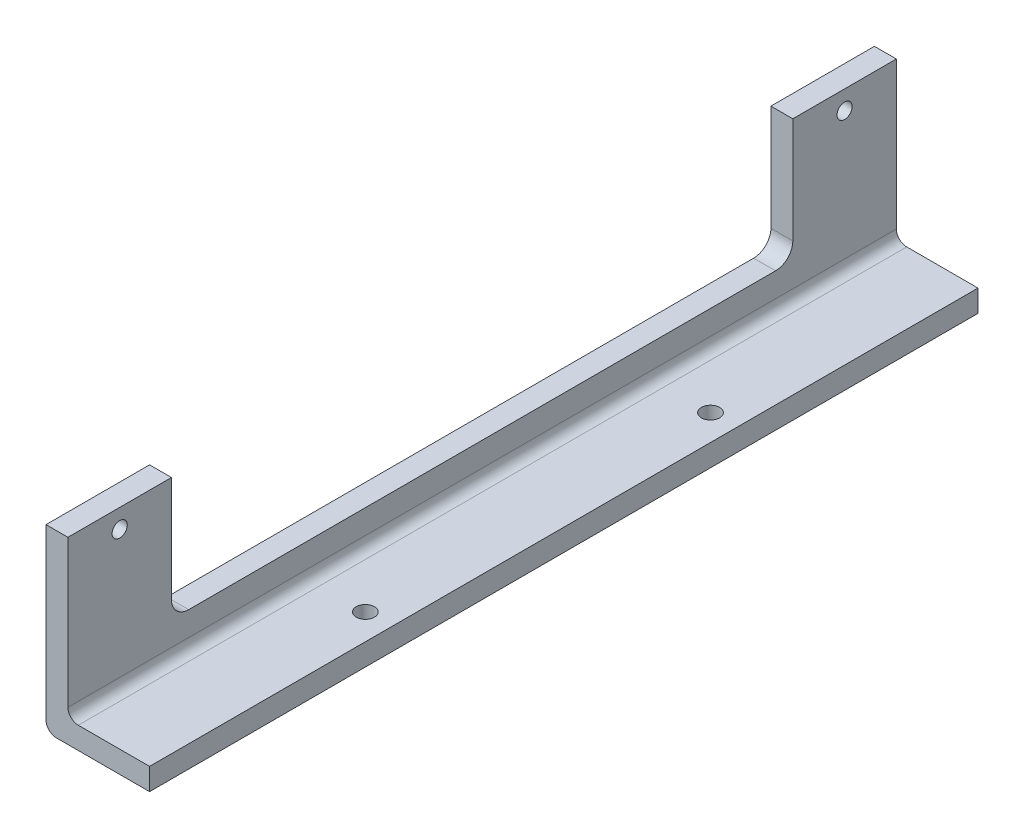
ISO-10303-21;
HEADER;
FILE_DESCRIPTION(('STEP AP214'),'2;1');
FILE_NAME('part.step','',(''),(''),'','','');
FILE_SCHEMA(('AUTOMOTIVE_DESIGN { 1 0 10303 214 1 1 1 1 }'));
ENDSEC;
DATA;
#1=APPLICATION_CONTEXT('core data for automotive mechanical design processes');
#2=APPLICATION_PROTOCOL_DEFINITION('international standard','automotive_design',2000,#1);
#3=PRODUCT_CONTEXT('',#1,'mechanical');
#4=PRODUCT('Part','Part','',(#3));
#5=PRODUCT_RELATED_PRODUCT_CATEGORY('part','',(#4));
#6=PRODUCT_DEFINITION_FORMATION('','',#4);
#7=PRODUCT_DEFINITION_CONTEXT('part definition',#1,'design');
#8=PRODUCT_DEFINITION('design','',#6,#7);
#9=PRODUCT_DEFINITION_SHAPE('','',#8);
#10=(LENGTH_UNIT() NAMED_UNIT(*) SI_UNIT(.MILLI.,.METRE.));
#11=(NAMED_UNIT(*) PLANE_ANGLE_UNIT() SI_UNIT($,.RADIAN.));
#12=(NAMED_UNIT(*) SI_UNIT($,.STERADIAN.) SOLID_ANGLE_UNIT());
#13=UNCERTAINTY_MEASURE_WITH_UNIT(LENGTH_MEASURE(1.E-05),#10,'distance_accuracy_value','');
#14=(GEOMETRIC_REPRESENTATION_CONTEXT(3) GLOBAL_UNCERTAINTY_ASSIGNED_CONTEXT((#13)) GLOBAL_UNIT_ASSIGNED_CONTEXT((#10,
#11,#12)) REPRESENTATION_CONTEXT('',''));
#15=CARTESIAN_POINT('',(0.,0.,0.));
#16=DIRECTION('',(0.,0.,1.));
#17=DIRECTION('',(1.,0.,0.));
#18=AXIS2_PLACEMENT_3D('',#15,#16,#17);
#19=CARTESIAN_POINT('',(0.,52.,5.));
#20=DIRECTION('',(0.,-1.,0.));
#21=DIRECTION('',(0.,0.,-1.));
#22=AXIS2_PLACEMENT_3D('',#19,#20,#21);
#23=PLANE('',#22);
#24=DIRECTION('',(0.,0.,-1.));
#25=VECTOR('',#24,1.);
#26=CARTESIAN_POINT('',(6.34999999999999,52.,5.));
#27=LINE('',#26,#25);
#28=CARTESIAN_POINT('',(6.34999999999999,52.,0.));
#29=VERTEX_POINT('',#28);
#30=CARTESIAN_POINT('',(6.34999999999999,52.,-30.));
#31=VERTEX_POINT('',#30);
#32=EDGE_CURVE('E210',#29,#31,#27,.T.);
#33=ORIENTED_EDGE('',*,*,#32,.T.);
#34=DIRECTION('',(-1.,0.,0.));
#35=VECTOR('',#34,1.);
#36=CARTESIAN_POINT('',(0.,52.,-30.));
#37=LINE('',#36,#35);
#38=CARTESIAN_POINT('',(0.,52.,-30.));
#39=VERTEX_POINT('',#38);
#40=EDGE_CURVE('E250',#31,#39,#37,.T.);
#41=ORIENTED_EDGE('',*,*,#40,.T.);
#42=DIRECTION('',(0.,0.,-1.));
#43=VECTOR('',#42,1.);
#44=CARTESIAN_POINT('',(0.,52.,5.));
#45=LINE('',#44,#43);
#46=CARTESIAN_POINT('',(0.,52.,0.));
#47=VERTEX_POINT('',#46);
#48=EDGE_CURVE('E178',#47,#39,#45,.T.);
#49=ORIENTED_EDGE('',*,*,#48,.F.);
#50=DIRECTION('',(-1.,0.,0.));
#51=VECTOR('',#50,1.);
#52=CARTESIAN_POINT('',(6.34999999999999,52.,0.));
#53=LINE('',#52,#51);
#54=EDGE_CURVE('E244',#29,#47,#53,.T.);
#55=ORIENTED_EDGE('',*,*,#54,.F.);
#56=EDGE_LOOP('',(#33,#41,#49,#55));
#57=FACE_BOUND('',#56,.T.);
#58=ADVANCED_FACE('F52',(#57),#23,.F.);
#59=CARTESIAN_POINT('',(6.35000000000002,0.,-240.));
#60=DIRECTION('',(1.,0.,0.));
#61=DIRECTION('',(0.,0.,-1.));
#62=AXIS2_PLACEMENT_3D('',#59,#60,#61);
#63=PLANE('',#62);
#64=CARTESIAN_POINT('',(6.35000000000002,46.5,-15.));
#65=DIRECTION('',(1.,0.,0.));
#66=DIRECTION('',(0.,0.,-1.));
#67=AXIS2_PLACEMENT_3D('',#64,#65,#66);
#68=CIRCLE('',#67,2.1971);
#69=CARTESIAN_POINT('',(6.35000000000002,46.5,-17.1971));
#70=VERTEX_POINT('',#69);
#71=EDGE_CURVE('E256',#70,#70,#68,.T.);
#72=ORIENTED_EDGE('',*,*,#71,.F.);
#73=EDGE_LOOP('',(#72));
#74=FACE_BOUND('',#73,.T.);
#75=CARTESIAN_POINT('',(6.35000000000005,46.5,-225.));
#76=DIRECTION('',(1.,0.,0.));
#77=DIRECTION('',(0.,0.,-1.));
#78=AXIS2_PLACEMENT_3D('',#75,#76,#77);
#79=CIRCLE('',#78,2.1971);
#80=CARTESIAN_POINT('',(6.35000000000005,46.5,-227.1971));
#81=VERTEX_POINT('',#80);
#82=EDGE_CURVE('E402',#81,#81,#79,.T.);
#83=ORIENTED_EDGE('',*,*,#82,.F.);
#84=EDGE_LOOP('',(#83));
#85=FACE_BOUND('',#84,.T.);
#86=DIRECTION('',(0.,1.,0.));
#87=VECTOR('',#86,1.);
#88=CARTESIAN_POINT('',(6.34999999999999,0.,0.));
#89=LINE('',#88,#87);
#90=CARTESIAN_POINT('',(6.35000000000002,9.35000000000001,0.));
#91=VERTEX_POINT('',#90);
#92=EDGE_CURVE('E222',#91,#29,#89,.T.);
#93=ORIENTED_EDGE('',*,*,#92,.F.);
#94=DIRECTION('',(0.,0.,1.));
#95=VECTOR('',#94,1.);
#96=CARTESIAN_POINT('',(6.35000000000005,9.35000000000001,-240.));
#97=LINE('',#96,#95);
#98=CARTESIAN_POINT('',(6.35000000000005,9.35000000000001,-240.));
#99=VERTEX_POINT('',#98);
#100=EDGE_CURVE('E73',#91,#99,#97,.F.);
#101=ORIENTED_EDGE('',*,*,#100,.T.);
#102=DIRECTION('',(0.,1.,0.));
#103=VECTOR('',#102,1.);
#104=CARTESIAN_POINT('',(6.35000000000002,0.,-240.));
#105=LINE('',#104,#103);
#106=CARTESIAN_POINT('',(6.35000000000002,52.,-240.));
#107=VERTEX_POINT('',#106);
#108=EDGE_CURVE('E223',#99,#107,#105,.T.);
#109=ORIENTED_EDGE('',*,*,#108,.T.);
#110=CARTESIAN_POINT('',(6.35000000000002,52.,-210.));
#111=VERTEX_POINT('',#110);
#112=EDGE_CURVE('E203',#111,#107,#27,.T.);
#113=ORIENTED_EDGE('',*,*,#112,.F.);
#114=DIRECTION('',(0.,1.,0.));
#115=VECTOR('',#114,1.);
#116=CARTESIAN_POINT('',(6.35000000000004,66.35,-210.));
#117=LINE('',#116,#115);
#118=CARTESIAN_POINT('',(6.35000000000002,21.35,-210.));
#119=VERTEX_POINT('',#118);
#120=EDGE_CURVE('E179',#119,#111,#117,.T.);
#121=ORIENTED_EDGE('',*,*,#120,.F.);
#122=CARTESIAN_POINT('',(6.35000000000002,21.35,-205.));
#123=DIRECTION('',(1.,0.,0.));
#124=DIRECTION('',(0.,0.,1.));
#125=AXIS2_PLACEMENT_3D('',#122,#123,#124);
#126=CIRCLE('',#125,5.);
#127=CARTESIAN_POINT('',(6.35000000000004,16.35,-205.));
#128=VERTEX_POINT('',#127);
#129=EDGE_CURVE('E181',#128,#119,#126,.T.);
#130=ORIENTED_EDGE('',*,*,#129,.F.);
#131=DIRECTION('',(0.,0.,-1.));
#132=VECTOR('',#131,1.);
#133=CARTESIAN_POINT('',(6.35000000000002,16.35,-35.));
#134=LINE('',#133,#132);
#135=CARTESIAN_POINT('',(6.35000000000002,16.35,-35.));
#136=VERTEX_POINT('',#135);
#137=EDGE_CURVE('E196',#136,#128,#134,.T.);
#138=ORIENTED_EDGE('',*,*,#137,.F.);
#139=CARTESIAN_POINT('',(6.35000000000001,21.35,-35.));
#140=DIRECTION('',(1.,0.,0.));
#141=DIRECTION('',(0.,0.,1.));
#142=AXIS2_PLACEMENT_3D('',#139,#140,#141);
#143=CIRCLE('',#142,5.);
#144=CARTESIAN_POINT('',(6.35000000000001,21.35,-30.));
#145=VERTEX_POINT('',#144);
#146=EDGE_CURVE('E194',#145,#136,#143,.T.);
#147=ORIENTED_EDGE('',*,*,#146,.F.);
#148=DIRECTION('',(0.,-1.,0.));
#149=VECTOR('',#148,1.);
#150=CARTESIAN_POINT('',(6.35000000000002,66.35,-30.));
#151=LINE('',#150,#149);
#152=EDGE_CURVE('E159',#31,#145,#151,.T.);
#153=ORIENTED_EDGE('',*,*,#152,.F.);
#154=ORIENTED_EDGE('',*,*,#32,.F.);
#155=EDGE_LOOP('',(#93,#101,#109,#113,#121,#130,#138,#147,#153,#154));
#156=FACE_BOUND('',#155,.T.);
#157=ADVANCED_FACE('F282',(#74,#85,#156),#63,.T.);
#158=CARTESIAN_POINT('',(0.,6.35000000000002,-240.));
#159=DIRECTION('',(0.,1.,0.));
#160=DIRECTION('',(0.,0.,1.));
#161=AXIS2_PLACEMENT_3D('',#158,#159,#160);
#162=PLANE('',#161);
#163=CARTESIAN_POINT('',(22.5,6.35000000000001,-69.9999999999999));
#164=DIRECTION('',(0.,1.,0.));
#165=DIRECTION('',(0.,0.,1.));
#166=AXIS2_PLACEMENT_3D('',#163,#164,#165);
#167=CIRCLE('',#166,2.63778999999999);
#168=CARTESIAN_POINT('',(22.5,6.35000000000001,-67.3622099999999));
#169=VERTEX_POINT('',#168);
#170=EDGE_CURVE('E384',#169,#169,#167,.T.);
#171=ORIENTED_EDGE('',*,*,#170,.F.);
#172=EDGE_LOOP('',(#171));
#173=FACE_BOUND('',#172,.T.);
#174=CARTESIAN_POINT('',(22.5,6.35000000000002,-170.));
#175=DIRECTION('',(0.,1.,0.));
#176=DIRECTION('',(0.,0.,1.));
#177=AXIS2_PLACEMENT_3D('',#174,#175,#176);
#178=CIRCLE('',#177,2.63778999999999);
#179=CARTESIAN_POINT('',(22.5,6.35000000000002,-167.36221));
#180=VERTEX_POINT('',#179);
#181=EDGE_CURVE('E261',#180,#180,#178,.T.);
#182=ORIENTED_EDGE('',*,*,#181,.F.);
#183=EDGE_LOOP('',(#182));
#184=FACE_BOUND('',#183,.T.);
#185=DIRECTION('',(1.,0.,0.));
#186=VECTOR('',#185,1.);
#187=CARTESIAN_POINT('',(0.,6.35000000000002,-240.));
#188=LINE('',#187,#186);
#189=CARTESIAN_POINT('',(30.0000000000001,6.35000000000001,-240.));
#190=VERTEX_POINT('',#189);
#191=CARTESIAN_POINT('',(9.35000000000002,6.35000000000002,-240.));
#192=VERTEX_POINT('',#191);
#193=EDGE_CURVE('E231',#190,#192,#188,.F.);
#194=ORIENTED_EDGE('',*,*,#193,.T.);
#195=DIRECTION('',(0.,0.,1.));
#196=VECTOR('',#195,1.);
#197=CARTESIAN_POINT('',(9.35,6.35,1.11022302462516E-13));
#198=LINE('',#197,#196);
#199=CARTESIAN_POINT('',(9.35,6.35,1.11022302462516E-13));
#200=VERTEX_POINT('',#199);
#201=EDGE_CURVE('E271',#192,#200,#198,.T.);
#202=ORIENTED_EDGE('',*,*,#201,.T.);
#203=DIRECTION('',(1.,0.,0.));
#204=VECTOR('',#203,1.);
#205=CARTESIAN_POINT('',(0.,6.35,0.));
#206=LINE('',#205,#204);
#207=CARTESIAN_POINT('',(30.,6.35,1.11022302462516E-13));
#208=VERTEX_POINT('',#207);
#209=EDGE_CURVE('E226',#208,#200,#206,.F.);
#210=ORIENTED_EDGE('',*,*,#209,.F.);
#211=DIRECTION('',(0.,0.,1.));
#212=VECTOR('',#211,1.);
#213=CARTESIAN_POINT('',(30.0000000000001,6.35000000000001,-245.));
#214=LINE('',#213,#212);
#215=EDGE_CURVE('E215',#190,#208,#214,.T.);
#216=ORIENTED_EDGE('',*,*,#215,.F.);
#217=EDGE_LOOP('',(#194,#202,#210,#216));
#218=FACE_BOUND('',#217,.T.);
#219=ADVANCED_FACE('F284',(#173,#184,#218),#162,.T.);
#220=CARTESIAN_POINT('',(0.,0.,-240.));
#221=DIRECTION('',(0.,1.,0.));
#222=DIRECTION('',(0.,0.,1.));
#223=AXIS2_PLACEMENT_3D('',#220,#221,#222);
#224=PLANE('',#223);
#225=CARTESIAN_POINT('',(22.5,0.,-69.9999999999999));
#226=DIRECTION('',(0.,1.,0.));
#227=DIRECTION('',(0.,0.,1.));
#228=AXIS2_PLACEMENT_3D('',#225,#226,#227);
#229=CIRCLE('',#228,2.1971);
#230=CARTESIAN_POINT('',(22.5,0.,-67.8028999999999));
#231=VERTEX_POINT('',#230);
#232=EDGE_CURVE('E258',#231,#231,#229,.T.);
#233=ORIENTED_EDGE('',*,*,#232,.T.);
#234=EDGE_LOOP('',(#233));
#235=FACE_BOUND('',#234,.T.);
#236=CARTESIAN_POINT('',(22.5,0.,-170.));
#237=DIRECTION('',(0.,1.,0.));
#238=DIRECTION('',(0.,0.,1.));
#239=AXIS2_PLACEMENT_3D('',#236,#237,#238);
#240=CIRCLE('',#239,2.1971);
#241=CARTESIAN_POINT('',(22.5,0.,-167.8029));
#242=VERTEX_POINT('',#241);
#243=EDGE_CURVE('E253',#242,#242,#240,.T.);
#244=ORIENTED_EDGE('',*,*,#243,.T.);
#245=EDGE_LOOP('',(#244));
#246=FACE_BOUND('',#245,.T.);
#247=DIRECTION('',(-1.,0.,0.));
#248=VECTOR('',#247,1.);
#249=CARTESIAN_POINT('',(0.,0.,0.));
#250=LINE('',#249,#248);
#251=CARTESIAN_POINT('',(30.0000000000001,0.,1.11022302462516E-13));
#252=VERTEX_POINT('',#251);
#253=CARTESIAN_POINT('',(3.,0.,1.11022302462516E-13));
#254=VERTEX_POINT('',#253);
#255=EDGE_CURVE('E237',#252,#254,#250,.T.);
#256=ORIENTED_EDGE('',*,*,#255,.T.);
#257=DIRECTION('',(0.,0.,1.));
#258=VECTOR('',#257,1.);
#259=CARTESIAN_POINT('',(3.00000000000003,0.,-240.));
#260=LINE('',#259,#258);
#261=CARTESIAN_POINT('',(3.00000000000003,0.,-240.));
#262=VERTEX_POINT('',#261);
#263=EDGE_CURVE('E267',#254,#262,#260,.F.);
#264=ORIENTED_EDGE('',*,*,#263,.T.);
#265=DIRECTION('',(-1.,0.,0.));
#266=VECTOR('',#265,1.);
#267=CARTESIAN_POINT('',(0.,0.,-240.));
#268=LINE('',#267,#266);
#269=CARTESIAN_POINT('',(30.0000000000001,0.,-240.));
#270=VERTEX_POINT('',#269);
#271=EDGE_CURVE('E228',#270,#262,#268,.T.);
#272=ORIENTED_EDGE('',*,*,#271,.F.);
#273=DIRECTION('',(0.,0.,1.));
#274=VECTOR('',#273,1.);
#275=CARTESIAN_POINT('',(30.0000000000001,0.,-245.));
#276=LINE('',#275,#274);
#277=EDGE_CURVE('E216',#270,#252,#276,.T.);
#278=ORIENTED_EDGE('',*,*,#277,.T.);
#279=EDGE_LOOP('',(#256,#264,#272,#278));
#280=FACE_BOUND('',#279,.T.);
#281=ADVANCED_FACE('F292',(#235,#246,#280),#224,.F.);
#282=CARTESIAN_POINT('',(0.,0.,-240.));
#283=DIRECTION('',(1.,0.,0.));
#284=DIRECTION('',(0.,0.,-1.));
#285=AXIS2_PLACEMENT_3D('',#282,#283,#284);
#286=PLANE('',#285);
#287=CARTESIAN_POINT('',(0.,46.5,-15.));
#288=DIRECTION('',(1.,0.,0.));
#289=DIRECTION('',(0.,0.,-1.));
#290=AXIS2_PLACEMENT_3D('',#287,#288,#289);
#291=CIRCLE('',#290,2.1971);
#292=CARTESIAN_POINT('',(0.,46.5,-17.1971));
#293=VERTEX_POINT('',#292);
#294=EDGE_CURVE('E400',#293,#293,#291,.T.);
#295=ORIENTED_EDGE('',*,*,#294,.T.);
#296=EDGE_LOOP('',(#295));
#297=FACE_BOUND('',#296,.T.);
#298=CARTESIAN_POINT('',(0.,46.5,-225.));
#299=DIRECTION('',(1.,0.,0.));
#300=DIRECTION('',(0.,0.,-1.));
#301=AXIS2_PLACEMENT_3D('',#298,#299,#300);
#302=CIRCLE('',#301,2.1971);
#303=CARTESIAN_POINT('',(0.,46.5,-227.1971));
#304=VERTEX_POINT('',#303);
#305=EDGE_CURVE('E184',#304,#304,#302,.T.);
#306=ORIENTED_EDGE('',*,*,#305,.T.);
#307=EDGE_LOOP('',(#306));
#308=FACE_BOUND('',#307,.T.);
#309=DIRECTION('',(0.,1.,0.));
#310=VECTOR('',#309,1.);
#311=CARTESIAN_POINT('',(0.,0.,-240.));
#312=LINE('',#311,#310);
#313=CARTESIAN_POINT('',(0.,3.00000000000002,-240.));
#314=VERTEX_POINT('',#313);
#315=CARTESIAN_POINT('',(0.,52.,-240.));
#316=VERTEX_POINT('',#315);
#317=EDGE_CURVE('E225',#314,#316,#312,.T.);
#318=ORIENTED_EDGE('',*,*,#317,.F.);
#319=DIRECTION('',(0.,0.,1.));
#320=VECTOR('',#319,1.);
#321=CARTESIAN_POINT('',(0.,3.00000000000002,-240.));
#322=LINE('',#321,#320);
#323=CARTESIAN_POINT('',(0.,3.,0.));
#324=VERTEX_POINT('',#323);
#325=EDGE_CURVE('E252',#314,#324,#322,.T.);
#326=ORIENTED_EDGE('',*,*,#325,.T.);
#327=DIRECTION('',(0.,1.,0.));
#328=VECTOR('',#327,1.);
#329=CARTESIAN_POINT('',(0.,0.,0.));
#330=LINE('',#329,#328);
#331=EDGE_CURVE('E235',#324,#47,#330,.T.);
#332=ORIENTED_EDGE('',*,*,#331,.T.);
#333=ORIENTED_EDGE('',*,*,#48,.T.);
#334=DIRECTION('',(0.,-1.,0.));
#335=VECTOR('',#334,1.);
#336=CARTESIAN_POINT('',(0.,66.35,-30.));
#337=LINE('',#336,#335);
#338=CARTESIAN_POINT('',(0.,21.35,-30.));
#339=VERTEX_POINT('',#338);
#340=EDGE_CURVE('E156',#39,#339,#337,.T.);
#341=ORIENTED_EDGE('',*,*,#340,.T.);
#342=CARTESIAN_POINT('',(0.,21.35,-35.));
#343=DIRECTION('',(1.,0.,0.));
#344=DIRECTION('',(0.,0.,1.));
#345=AXIS2_PLACEMENT_3D('',#342,#343,#344);
#346=CIRCLE('',#345,5.);
#347=CARTESIAN_POINT('',(0.,16.35,-35.));
#348=VERTEX_POINT('',#347);
#349=EDGE_CURVE('E167',#339,#348,#346,.T.);
#350=ORIENTED_EDGE('',*,*,#349,.T.);
#351=DIRECTION('',(0.,0.,-1.));
#352=VECTOR('',#351,1.);
#353=CARTESIAN_POINT('',(0.,16.35,-35.));
#354=LINE('',#353,#352);
#355=CARTESIAN_POINT('',(0.,16.35,-205.));
#356=VERTEX_POINT('',#355);
#357=EDGE_CURVE('E172',#348,#356,#354,.T.);
#358=ORIENTED_EDGE('',*,*,#357,.T.);
#359=CARTESIAN_POINT('',(0.,21.35,-205.));
#360=DIRECTION('',(1.,0.,0.));
#361=DIRECTION('',(0.,0.,1.));
#362=AXIS2_PLACEMENT_3D('',#359,#360,#361);
#363=CIRCLE('',#362,5.);
#364=CARTESIAN_POINT('',(0.,21.35,-210.));
#365=VERTEX_POINT('',#364);
#366=EDGE_CURVE('E188',#356,#365,#363,.T.);
#367=ORIENTED_EDGE('',*,*,#366,.T.);
#368=DIRECTION('',(0.,1.,0.));
#369=VECTOR('',#368,1.);
#370=CARTESIAN_POINT('',(0.,66.35,-210.));
#371=LINE('',#370,#369);
#372=CARTESIAN_POINT('',(0.,52.,-210.));
#373=VERTEX_POINT('',#372);
#374=EDGE_CURVE('E164',#365,#373,#371,.T.);
#375=ORIENTED_EDGE('',*,*,#374,.T.);
#376=EDGE_CURVE('E209',#373,#316,#45,.T.);
#377=ORIENTED_EDGE('',*,*,#376,.T.);
#378=EDGE_LOOP('',(#318,#326,#332,#333,#341,#350,#358,#367,#375,#377));
#379=FACE_BOUND('',#378,.T.);
#380=ADVANCED_FACE('F176',(#297,#308,#379),#286,.F.);
#381=CARTESIAN_POINT('',(6.35000000000002,55.,-240.));
#382=DIRECTION('',(0.,0.,-1.));
#383=DIRECTION('',(-1.,0.,0.));
#384=AXIS2_PLACEMENT_3D('',#381,#382,#383);
#385=PLANE('',#384);
#386=ORIENTED_EDGE('',*,*,#271,.T.);
#387=CARTESIAN_POINT('',(3.00000000000003,3.00000000000002,-240.));
#388=DIRECTION('',(0.,0.,-1.));
#389=DIRECTION('',(-1.,0.,0.));
#390=AXIS2_PLACEMENT_3D('',#387,#388,#389);
#391=CIRCLE('',#390,3.);
#392=EDGE_CURVE('E269',#262,#314,#391,.T.);
#393=ORIENTED_EDGE('',*,*,#392,.T.);
#394=ORIENTED_EDGE('',*,*,#317,.T.);
#395=DIRECTION('',(-1.,0.,0.));
#396=VECTOR('',#395,1.);
#397=CARTESIAN_POINT('',(6.35000000000002,52.,-240.));
#398=LINE('',#397,#396);
#399=EDGE_CURVE('E208',#107,#316,#398,.T.);
#400=ORIENTED_EDGE('',*,*,#399,.F.);
#401=ORIENTED_EDGE('',*,*,#108,.F.);
#402=CARTESIAN_POINT('',(9.35000000000005,9.35000000000002,-240.));
#403=DIRECTION('',(0.,0.,-1.));
#404=DIRECTION('',(-1.,0.,0.));
#405=AXIS2_PLACEMENT_3D('',#402,#403,#404);
#406=CIRCLE('',#405,3.);
#407=EDGE_CURVE('E13',#99,#192,#406,.F.);
#408=ORIENTED_EDGE('',*,*,#407,.T.);
#409=ORIENTED_EDGE('',*,*,#193,.F.);
#410=DIRECTION('',(0.,1.,0.));
#411=VECTOR('',#410,1.);
#412=CARTESIAN_POINT('',(30.0000000000001,55.,-240.));
#413=LINE('',#412,#411);
#414=EDGE_CURVE('E219',#270,#190,#413,.T.);
#415=ORIENTED_EDGE('',*,*,#414,.F.);
#416=EDGE_LOOP('',(#386,#393,#394,#400,#401,#408,#409,#415));
#417=FACE_BOUND('',#416,.T.);
#418=ADVANCED_FACE('F287',(#417),#385,.T.);
#419=CARTESIAN_POINT('',(6.34999999999999,55.,0.));
#420=DIRECTION('',(0.,0.,-1.));
#421=DIRECTION('',(-1.,0.,0.));
#422=AXIS2_PLACEMENT_3D('',#419,#420,#421);
#423=PLANE('',#422);
#424=ORIENTED_EDGE('',*,*,#331,.F.);
#425=CARTESIAN_POINT('',(3.,3.,1.11022302462516E-13));
#426=DIRECTION('',(0.,0.,-1.));
#427=DIRECTION('',(-1.,0.,0.));
#428=AXIS2_PLACEMENT_3D('',#425,#426,#427);
#429=CIRCLE('',#428,3.);
#430=EDGE_CURVE('E265',#324,#254,#429,.F.);
#431=ORIENTED_EDGE('',*,*,#430,.T.);
#432=ORIENTED_EDGE('',*,*,#255,.F.);
#433=DIRECTION('',(0.,1.,0.));
#434=VECTOR('',#433,1.);
#435=CARTESIAN_POINT('',(30.0000000000001,55.,1.11022302462516E-13));
#436=LINE('',#435,#434);
#437=EDGE_CURVE('E233',#252,#208,#436,.T.);
#438=ORIENTED_EDGE('',*,*,#437,.T.);
#439=ORIENTED_EDGE('',*,*,#209,.T.);
#440=CARTESIAN_POINT('',(9.35000000000002,9.35,1.11022302462516E-13));
#441=DIRECTION('',(0.,0.,-1.));
#442=DIRECTION('',(-1.,0.,0.));
#443=AXIS2_PLACEMENT_3D('',#440,#441,#442);
#444=CIRCLE('',#443,3.);
#445=EDGE_CURVE('E60',#200,#91,#444,.T.);
#446=ORIENTED_EDGE('',*,*,#445,.T.);
#447=ORIENTED_EDGE('',*,*,#92,.T.);
#448=ORIENTED_EDGE('',*,*,#54,.T.);
#449=EDGE_LOOP('',(#424,#431,#432,#438,#439,#446,#447,#448));
#450=FACE_BOUND('',#449,.T.);
#451=ADVANCED_FACE('F276',(#450),#423,.F.);
#452=CARTESIAN_POINT('',(30.0000000000001,0.,-245.));
#453=DIRECTION('',(-1.,0.,0.));
#454=DIRECTION('',(0.,0.,1.));
#455=AXIS2_PLACEMENT_3D('',#452,#453,#454);
#456=PLANE('',#455);
#457=ORIENTED_EDGE('',*,*,#414,.T.);
#458=ORIENTED_EDGE('',*,*,#215,.T.);
#459=ORIENTED_EDGE('',*,*,#437,.F.);
#460=ORIENTED_EDGE('',*,*,#277,.F.);
#461=EDGE_LOOP('',(#457,#458,#459,#460));
#462=FACE_BOUND('',#461,.T.);
#463=ADVANCED_FACE('F317',(#462),#456,.F.);
#464=ORIENTED_EDGE('',*,*,#376,.F.);
#465=DIRECTION('',(1.,0.,0.));
#466=VECTOR('',#465,1.);
#467=CARTESIAN_POINT('',(0.,52.,-210.));
#468=LINE('',#467,#466);
#469=EDGE_CURVE('E247',#373,#111,#468,.T.);
#470=ORIENTED_EDGE('',*,*,#469,.T.);
#471=ORIENTED_EDGE('',*,*,#112,.T.);
#472=ORIENTED_EDGE('',*,*,#399,.T.);
#473=EDGE_LOOP('',(#464,#470,#471,#472));
#474=FACE_BOUND('',#473,.T.);
#475=ADVANCED_FACE('F304',(#474),#23,.F.);
#476=CARTESIAN_POINT('',(0.,66.35,-30.));
#477=DIRECTION('',(0.,0.,1.));
#478=DIRECTION('',(0.,-1.,0.));
#479=AXIS2_PLACEMENT_3D('',#476,#477,#478);
#480=PLANE('',#479);
#481=ORIENTED_EDGE('',*,*,#152,.T.);
#482=DIRECTION('',(1.,0.,0.));
#483=VECTOR('',#482,1.);
#484=CARTESIAN_POINT('',(0.,21.35,-30.));
#485=LINE('',#484,#483);
#486=EDGE_CURVE('E152',#339,#145,#485,.T.);
#487=ORIENTED_EDGE('',*,*,#486,.F.);
#488=ORIENTED_EDGE('',*,*,#340,.F.);
#489=ORIENTED_EDGE('',*,*,#40,.F.);
#490=EDGE_LOOP('',(#481,#487,#488,#489));
#491=FACE_BOUND('',#490,.T.);
#492=ADVANCED_FACE('F154',(#491),#480,.F.);
#493=CARTESIAN_POINT('',(0.,66.35,-210.));
#494=DIRECTION('',(0.,0.,-1.));
#495=DIRECTION('',(-1.,0.,0.));
#496=AXIS2_PLACEMENT_3D('',#493,#494,#495);
#497=PLANE('',#496);
#498=ORIENTED_EDGE('',*,*,#374,.F.);
#499=DIRECTION('',(1.,0.,0.));
#500=VECTOR('',#499,1.);
#501=CARTESIAN_POINT('',(0.,21.35,-210.));
#502=LINE('',#501,#500);
#503=EDGE_CURVE('E201',#365,#119,#502,.T.);
#504=ORIENTED_EDGE('',*,*,#503,.T.);
#505=ORIENTED_EDGE('',*,*,#120,.T.);
#506=ORIENTED_EDGE('',*,*,#469,.F.);
#507=EDGE_LOOP('',(#498,#504,#505,#506));
#508=FACE_BOUND('',#507,.T.);
#509=ADVANCED_FACE('F310',(#508),#497,.F.);
#510=CARTESIAN_POINT('',(0.,21.35,-205.));
#511=DIRECTION('',(1.,0.,0.));
#512=DIRECTION('',(0.,0.,-1.));
#513=AXIS2_PLACEMENT_3D('',#510,#511,#512);
#514=CYLINDRICAL_SURFACE('',#513,5.);
#515=ORIENTED_EDGE('',*,*,#129,.T.);
#516=ORIENTED_EDGE('',*,*,#503,.F.);
#517=ORIENTED_EDGE('',*,*,#366,.F.);
#518=DIRECTION('',(1.,0.,0.));
#519=VECTOR('',#518,1.);
#520=CARTESIAN_POINT('',(0.,16.35,-205.));
#521=LINE('',#520,#519);
#522=EDGE_CURVE('E204',#356,#128,#521,.T.);
#523=ORIENTED_EDGE('',*,*,#522,.T.);
#524=EDGE_LOOP('',(#515,#516,#517,#523));
#525=FACE_BOUND('',#524,.T.);
#526=ADVANCED_FACE('F313',(#525),#514,.F.);
#527=CARTESIAN_POINT('',(0.,16.35,-35.));
#528=DIRECTION('',(0.,-1.,0.));
#529=DIRECTION('',(0.,0.,-1.));
#530=AXIS2_PLACEMENT_3D('',#527,#528,#529);
#531=PLANE('',#530);
#532=ORIENTED_EDGE('',*,*,#137,.T.);
#533=ORIENTED_EDGE('',*,*,#522,.F.);
#534=ORIENTED_EDGE('',*,*,#357,.F.);
#535=DIRECTION('',(1.,0.,0.));
#536=VECTOR('',#535,1.);
#537=CARTESIAN_POINT('',(0.,16.35,-35.));
#538=LINE('',#537,#536);
#539=EDGE_CURVE('E163',#348,#136,#538,.T.);
#540=ORIENTED_EDGE('',*,*,#539,.T.);
#541=EDGE_LOOP('',(#532,#533,#534,#540));
#542=FACE_BOUND('',#541,.T.);
#543=ADVANCED_FACE('F315',(#542),#531,.F.);
#544=CARTESIAN_POINT('',(0.,21.35,-35.));
#545=DIRECTION('',(1.,0.,0.));
#546=DIRECTION('',(0.,0.,-1.));
#547=AXIS2_PLACEMENT_3D('',#544,#545,#546);
#548=CYLINDRICAL_SURFACE('',#547,5.);
#549=ORIENTED_EDGE('',*,*,#146,.T.);
#550=ORIENTED_EDGE('',*,*,#539,.F.);
#551=ORIENTED_EDGE('',*,*,#349,.F.);
#552=ORIENTED_EDGE('',*,*,#486,.T.);
#553=EDGE_LOOP('',(#549,#550,#551,#552));
#554=FACE_BOUND('',#553,.T.);
#555=ADVANCED_FACE('F168',(#554),#548,.F.);
#556=CARTESIAN_POINT('',(6.35000000000005,46.5,-225.));
#557=DIRECTION('',(1.,0.,0.));
#558=DIRECTION('',(0.,0.,-1.));
#559=AXIS2_PLACEMENT_3D('',#556,#557,#558);
#560=CYLINDRICAL_SURFACE('',#559,2.1971);
#561=ORIENTED_EDGE('',*,*,#305,.F.);
#562=EDGE_LOOP('',(#561));
#563=FACE_BOUND('',#562,.T.);
#564=ORIENTED_EDGE('',*,*,#82,.T.);
#565=EDGE_LOOP('',(#564));
#566=FACE_BOUND('',#565,.T.);
#567=ADVANCED_FACE('F338',(#563,#566),#560,.F.);
#568=CARTESIAN_POINT('',(6.35000000000002,46.5,-15.));
#569=DIRECTION('',(1.,0.,0.));
#570=DIRECTION('',(0.,0.,-1.));
#571=AXIS2_PLACEMENT_3D('',#568,#569,#570);
#572=CYLINDRICAL_SURFACE('',#571,2.1971);
#573=ORIENTED_EDGE('',*,*,#294,.F.);
#574=EDGE_LOOP('',(#573));
#575=FACE_BOUND('',#574,.T.);
#576=ORIENTED_EDGE('',*,*,#71,.T.);
#577=EDGE_LOOP('',(#576));
#578=FACE_BOUND('',#577,.T.);
#579=ADVANCED_FACE('F347',(#575,#578),#572,.F.);
#580=CARTESIAN_POINT('',(22.5,6.35000000000002,-170.));
#581=DIRECTION('',(0.,1.,0.));
#582=DIRECTION('',(0.,0.,1.));
#583=AXIS2_PLACEMENT_3D('',#580,#581,#582);
#584=CYLINDRICAL_SURFACE('',#583,2.1971);
#585=CARTESIAN_POINT('',(22.5,1.27000000000001,-170.));
#586=DIRECTION('',(0.,1.,0.));
#587=DIRECTION('',(0.,0.,1.));
#588=AXIS2_PLACEMENT_3D('',#585,#586,#587);
#589=CIRCLE('',#588,2.1971);
#590=CARTESIAN_POINT('',(22.5,1.27000000000001,-167.8029));
#591=VERTEX_POINT('',#590);
#592=EDGE_CURVE('E257',#591,#591,#589,.T.);
#593=ORIENTED_EDGE('',*,*,#592,.T.);
#594=EDGE_LOOP('',(#593));
#595=FACE_BOUND('',#594,.T.);
#596=ORIENTED_EDGE('',*,*,#243,.F.);
#597=EDGE_LOOP('',(#596));
#598=FACE_BOUND('',#597,.T.);
#599=ADVANCED_FACE('F351',(#595,#598),#584,.F.);
#600=CARTESIAN_POINT('',(24.6971000000001,1.27000000000001,-170.));
#601=DIRECTION('',(0.,-1.,0.));
#602=DIRECTION('',(0.,0.,-1.));
#603=AXIS2_PLACEMENT_3D('',#600,#601,#602);
#604=PLANE('',#603);
#605=ORIENTED_EDGE('',*,*,#592,.F.);
#606=EDGE_LOOP('',(#605));
#607=FACE_BOUND('',#606,.T.);
#608=CARTESIAN_POINT('',(22.5,1.27000000000001,-170.));
#609=DIRECTION('',(0.,1.,0.));
#610=DIRECTION('',(0.,0.,1.));
#611=AXIS2_PLACEMENT_3D('',#608,#609,#610);
#612=CIRCLE('',#611,2.63778999999999);
#613=CARTESIAN_POINT('',(22.5,1.27000000000001,-167.36221));
#614=VERTEX_POINT('',#613);
#615=EDGE_CURVE('E393',#614,#614,#612,.T.);
#616=ORIENTED_EDGE('',*,*,#615,.T.);
#617=EDGE_LOOP('',(#616));
#618=FACE_BOUND('',#617,.T.);
#619=ADVANCED_FACE('F355',(#607,#618),#604,.F.);
#620=CARTESIAN_POINT('',(22.5,6.35000000000002,-170.));
#621=DIRECTION('',(0.,1.,0.));
#622=DIRECTION('',(0.,0.,1.));
#623=AXIS2_PLACEMENT_3D('',#620,#621,#622);
#624=CYLINDRICAL_SURFACE('',#623,2.63778999999999);
#625=ORIENTED_EDGE('',*,*,#615,.F.);
#626=EDGE_LOOP('',(#625));
#627=FACE_BOUND('',#626,.T.);
#628=ORIENTED_EDGE('',*,*,#181,.T.);
#629=EDGE_LOOP('',(#628));
#630=FACE_BOUND('',#629,.T.);
#631=ADVANCED_FACE('F359',(#627,#630),#624,.F.);
#632=CARTESIAN_POINT('',(22.5,6.35000000000001,-69.9999999999999));
#633=DIRECTION('',(0.,1.,0.));
#634=DIRECTION('',(0.,0.,1.));
#635=AXIS2_PLACEMENT_3D('',#632,#633,#634);
#636=CYLINDRICAL_SURFACE('',#635,2.1971);
#637=CARTESIAN_POINT('',(22.5,1.27000000000001,-69.9999999999999));
#638=DIRECTION('',(0.,1.,0.));
#639=DIRECTION('',(0.,0.,1.));
#640=AXIS2_PLACEMENT_3D('',#637,#638,#639);
#641=CIRCLE('',#640,2.1971);
#642=CARTESIAN_POINT('',(22.5,1.27000000000001,-67.8028999999999));
#643=VERTEX_POINT('',#642);
#644=EDGE_CURVE('E262',#643,#643,#641,.T.);
#645=ORIENTED_EDGE('',*,*,#644,.T.);
#646=EDGE_LOOP('',(#645));
#647=FACE_BOUND('',#646,.T.);
#648=ORIENTED_EDGE('',*,*,#232,.F.);
#649=EDGE_LOOP('',(#648));
#650=FACE_BOUND('',#649,.T.);
#651=ADVANCED_FACE('F363',(#647,#650),#636,.F.);
#652=CARTESIAN_POINT('',(24.6971,1.27,-70.));
#653=DIRECTION('',(0.,-1.,0.));
#654=DIRECTION('',(0.,0.,-1.));
#655=AXIS2_PLACEMENT_3D('',#652,#653,#654);
#656=PLANE('',#655);
#657=ORIENTED_EDGE('',*,*,#644,.F.);
#658=EDGE_LOOP('',(#657));
#659=FACE_BOUND('',#658,.T.);
#660=CARTESIAN_POINT('',(22.5,1.27000000000001,-69.9999999999999));
#661=DIRECTION('',(0.,1.,0.));
#662=DIRECTION('',(0.,0.,1.));
#663=AXIS2_PLACEMENT_3D('',#660,#661,#662);
#664=CIRCLE('',#663,2.63778999999999);
#665=CARTESIAN_POINT('',(22.5,1.27000000000001,-67.3622099999999));
#666=VERTEX_POINT('',#665);
#667=EDGE_CURVE('E381',#666,#666,#664,.T.);
#668=ORIENTED_EDGE('',*,*,#667,.T.);
#669=EDGE_LOOP('',(#668));
#670=FACE_BOUND('',#669,.T.);
#671=ADVANCED_FACE('F367',(#659,#670),#656,.F.);
#672=CARTESIAN_POINT('',(22.5,6.35000000000001,-69.9999999999999));
#673=DIRECTION('',(0.,1.,0.));
#674=DIRECTION('',(0.,0.,1.));
#675=AXIS2_PLACEMENT_3D('',#672,#673,#674);
#676=CYLINDRICAL_SURFACE('',#675,2.63778999999999);
#677=ORIENTED_EDGE('',*,*,#667,.F.);
#678=EDGE_LOOP('',(#677));
#679=FACE_BOUND('',#678,.T.);
#680=ORIENTED_EDGE('',*,*,#170,.T.);
#681=EDGE_LOOP('',(#680));
#682=FACE_BOUND('',#681,.T.);
#683=ADVANCED_FACE('F371',(#679,#682),#676,.F.);
#684=CARTESIAN_POINT('',(3.00000000000003,3.00000000000002,-240.));
#685=DIRECTION('',(0.,0.,1.));
#686=DIRECTION('',(1.,0.,0.));
#687=AXIS2_PLACEMENT_3D('',#684,#685,#686);
#688=CYLINDRICAL_SURFACE('',#687,3.);
#689=ORIENTED_EDGE('',*,*,#392,.F.);
#690=ORIENTED_EDGE('',*,*,#263,.F.);
#691=ORIENTED_EDGE('',*,*,#430,.F.);
#692=ORIENTED_EDGE('',*,*,#325,.F.);
#693=EDGE_LOOP('',(#689,#690,#691,#692));
#694=FACE_BOUND('',#693,.T.);
#695=ADVANCED_FACE('F296',(#694),#688,.T.);
#696=CARTESIAN_POINT('',(9.35000000000005,9.35000000000002,-240.));
#697=DIRECTION('',(0.,0.,-1.));
#698=DIRECTION('',(-1.,0.,0.));
#699=AXIS2_PLACEMENT_3D('',#696,#697,#698);
#700=CYLINDRICAL_SURFACE('',#699,3.);
#701=ORIENTED_EDGE('',*,*,#407,.F.);
#702=ORIENTED_EDGE('',*,*,#100,.F.);
#703=ORIENTED_EDGE('',*,*,#445,.F.);
#704=ORIENTED_EDGE('',*,*,#201,.F.);
#705=EDGE_LOOP('',(#701,#702,#703,#704));
#706=FACE_BOUND('',#705,.T.);
#707=ADVANCED_FACE('F54',(#706),#700,.F.);
#708=CLOSED_SHELL('',(#58,#157,#219,#281,#380,#418,#451,#463,#475,#492,#509,#526,#543,#555,#567,
#579,#599,#619,#631,#651,#671,#683,#695,#707));
#709=MANIFOLD_SOLID_BREP('B2',#708);
#710=ADVANCED_BREP_SHAPE_REPRESENTATION('',(#18,#709),#14);
#711=SHAPE_DEFINITION_REPRESENTATION(#9,#710);
ENDSEC;
END-ISO-10303-21;
